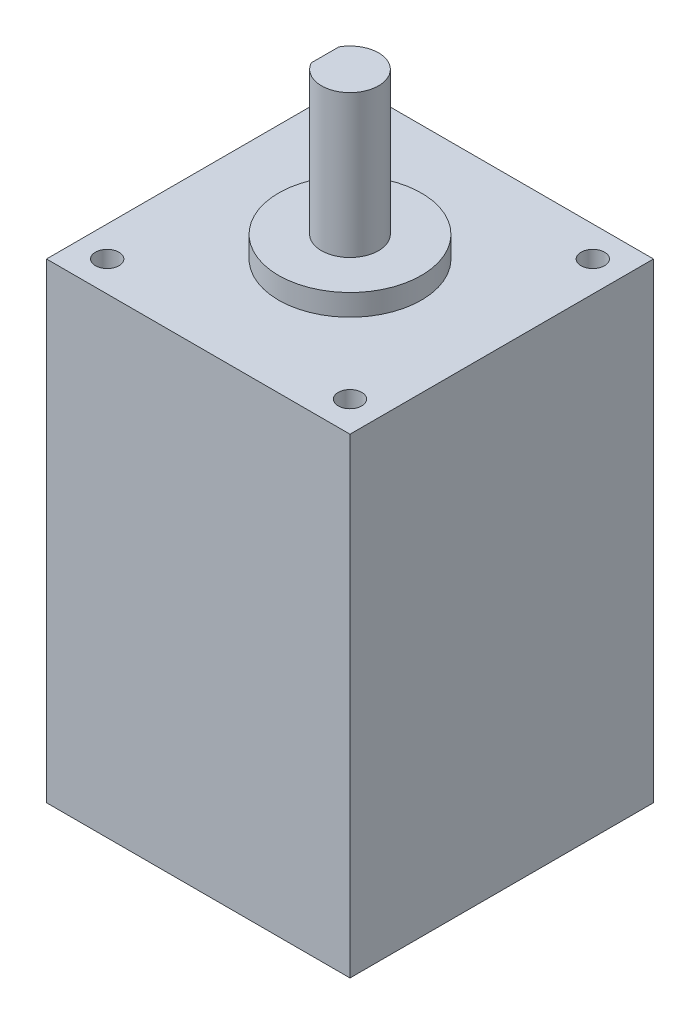
ISO-10303-21;
HEADER;
FILE_DESCRIPTION(('STEP AP214'),'2;1');
FILE_NAME('part.step','',(''),(''),'','','');
FILE_SCHEMA(('AUTOMOTIVE_DESIGN { 1 0 10303 214 1 1 1 1 }'));
ENDSEC;
DATA;
#1=APPLICATION_CONTEXT('core data for automotive mechanical design processes');
#2=APPLICATION_PROTOCOL_DEFINITION('international standard','automotive_design',2000,#1);
#3=PRODUCT_CONTEXT('',#1,'mechanical');
#4=PRODUCT('Part','Part','',(#3));
#5=PRODUCT_RELATED_PRODUCT_CATEGORY('part','',(#4));
#6=PRODUCT_DEFINITION_FORMATION('','',#4);
#7=PRODUCT_DEFINITION_CONTEXT('part definition',#1,'design');
#8=PRODUCT_DEFINITION('design','',#6,#7);
#9=PRODUCT_DEFINITION_SHAPE('','',#8);
#10=(LENGTH_UNIT() NAMED_UNIT(*) SI_UNIT(.MILLI.,.METRE.));
#11=(NAMED_UNIT(*) PLANE_ANGLE_UNIT() SI_UNIT($,.RADIAN.));
#12=(NAMED_UNIT(*) SI_UNIT($,.STERADIAN.) SOLID_ANGLE_UNIT());
#13=UNCERTAINTY_MEASURE_WITH_UNIT(LENGTH_MEASURE(1.E-05),#10,'distance_accuracy_value','');
#14=(GEOMETRIC_REPRESENTATION_CONTEXT(3) GLOBAL_UNCERTAINTY_ASSIGNED_CONTEXT((#13)) GLOBAL_UNIT_ASSIGNED_CONTEXT((#10,
#11,#12)) REPRESENTATION_CONTEXT('',''));
#15=CARTESIAN_POINT('',(0.,0.,0.));
#16=DIRECTION('',(0.,0.,1.));
#17=DIRECTION('',(1.,0.,0.));
#18=AXIS2_PLACEMENT_3D('',#15,#16,#17);
#19=CARTESIAN_POINT('',(0.,65.95,-42.5));
#20=DIRECTION('',(-1.,0.,0.));
#21=DIRECTION('',(0.,0.,1.));
#22=AXIS2_PLACEMENT_3D('',#19,#20,#21);
#23=PLANE('',#22);
#24=DIRECTION('',(0.,0.,-1.));
#25=VECTOR('',#24,1.);
#26=CARTESIAN_POINT('',(0.,0.,-42.5));
#27=LINE('',#26,#25);
#28=CARTESIAN_POINT('',(0.,0.,0.));
#29=VERTEX_POINT('',#28);
#30=CARTESIAN_POINT('',(0.,0.,-42.5));
#31=VERTEX_POINT('',#30);
#32=EDGE_CURVE('E164',#29,#31,#27,.T.);
#33=ORIENTED_EDGE('',*,*,#32,.T.);
#34=DIRECTION('',(0.,-1.,0.));
#35=VECTOR('',#34,1.);
#36=CARTESIAN_POINT('',(0.,65.95,-42.5));
#37=LINE('',#36,#35);
#38=CARTESIAN_POINT('',(0.,65.95,-42.5));
#39=VERTEX_POINT('',#38);
#40=EDGE_CURVE('E43',#39,#31,#37,.T.);
#41=ORIENTED_EDGE('',*,*,#40,.F.);
#42=DIRECTION('',(0.,0.,-1.));
#43=VECTOR('',#42,1.);
#44=CARTESIAN_POINT('',(0.,65.95,-42.5));
#45=LINE('',#44,#43);
#46=CARTESIAN_POINT('',(0.,65.95,0.));
#47=VERTEX_POINT('',#46);
#48=EDGE_CURVE('E167',#47,#39,#45,.T.);
#49=ORIENTED_EDGE('',*,*,#48,.F.);
#50=DIRECTION('',(0.,-1.,0.));
#51=VECTOR('',#50,1.);
#52=CARTESIAN_POINT('',(0.,65.95,0.));
#53=LINE('',#52,#51);
#54=EDGE_CURVE('E173',#47,#29,#53,.T.);
#55=ORIENTED_EDGE('',*,*,#54,.T.);
#56=EDGE_LOOP('',(#33,#41,#49,#55));
#57=FACE_BOUND('',#56,.T.);
#58=ADVANCED_FACE('F40',(#57),#23,.F.);
#59=CARTESIAN_POINT('',(-42.5,65.95,-42.5));
#60=DIRECTION('',(0.,0.,1.));
#61=DIRECTION('',(1.,0.,0.));
#62=AXIS2_PLACEMENT_3D('',#59,#60,#61);
#63=PLANE('',#62);
#64=DIRECTION('',(-1.,0.,0.));
#65=VECTOR('',#64,1.);
#66=CARTESIAN_POINT('',(-42.5,0.,-42.5));
#67=LINE('',#66,#65);
#68=CARTESIAN_POINT('',(-42.5,0.,-42.5));
#69=VERTEX_POINT('',#68);
#70=EDGE_CURVE('E176',#31,#69,#67,.T.);
#71=ORIENTED_EDGE('',*,*,#70,.T.);
#72=DIRECTION('',(0.,-1.,0.));
#73=VECTOR('',#72,1.);
#74=CARTESIAN_POINT('',(-42.5,65.95,-42.5));
#75=LINE('',#74,#73);
#76=CARTESIAN_POINT('',(-42.5,65.95,-42.5));
#77=VERTEX_POINT('',#76);
#78=EDGE_CURVE('E183',#77,#69,#75,.T.);
#79=ORIENTED_EDGE('',*,*,#78,.F.);
#80=DIRECTION('',(-1.,0.,0.));
#81=VECTOR('',#80,1.);
#82=CARTESIAN_POINT('',(-42.5,65.95,-42.5));
#83=LINE('',#82,#81);
#84=EDGE_CURVE('E94',#39,#77,#83,.T.);
#85=ORIENTED_EDGE('',*,*,#84,.F.);
#86=ORIENTED_EDGE('',*,*,#40,.T.);
#87=EDGE_LOOP('',(#71,#79,#85,#86));
#88=FACE_BOUND('',#87,.T.);
#89=ADVANCED_FACE('F189',(#88),#63,.F.);
#90=CARTESIAN_POINT('',(-42.5,65.95,0.));
#91=DIRECTION('',(1.,0.,0.));
#92=DIRECTION('',(0.,0.,-1.));
#93=AXIS2_PLACEMENT_3D('',#90,#91,#92);
#94=PLANE('',#93);
#95=DIRECTION('',(0.,0.,1.));
#96=VECTOR('',#95,1.);
#97=CARTESIAN_POINT('',(-42.5,0.,0.));
#98=LINE('',#97,#96);
#99=CARTESIAN_POINT('',(-42.5,0.,0.));
#100=VERTEX_POINT('',#99);
#101=EDGE_CURVE('E178',#69,#100,#98,.T.);
#102=ORIENTED_EDGE('',*,*,#101,.T.);
#103=DIRECTION('',(0.,-1.,0.));
#104=VECTOR('',#103,1.);
#105=CARTESIAN_POINT('',(-42.5,65.95,0.));
#106=LINE('',#105,#104);
#107=CARTESIAN_POINT('',(-42.5,65.95,0.));
#108=VERTEX_POINT('',#107);
#109=EDGE_CURVE('E182',#108,#100,#106,.T.);
#110=ORIENTED_EDGE('',*,*,#109,.F.);
#111=DIRECTION('',(0.,0.,1.));
#112=VECTOR('',#111,1.);
#113=CARTESIAN_POINT('',(-42.5,65.95,0.));
#114=LINE('',#113,#112);
#115=EDGE_CURVE('E170',#77,#108,#114,.T.);
#116=ORIENTED_EDGE('',*,*,#115,.F.);
#117=ORIENTED_EDGE('',*,*,#78,.T.);
#118=EDGE_LOOP('',(#102,#110,#116,#117));
#119=FACE_BOUND('',#118,.T.);
#120=ADVANCED_FACE('F196',(#119),#94,.F.);
#121=CARTESIAN_POINT('',(0.,65.95,0.));
#122=DIRECTION('',(0.,0.,-1.));
#123=DIRECTION('',(-1.,0.,0.));
#124=AXIS2_PLACEMENT_3D('',#121,#122,#123);
#125=PLANE('',#124);
#126=DIRECTION('',(1.,0.,0.));
#127=VECTOR('',#126,1.);
#128=CARTESIAN_POINT('',(0.,0.,0.));
#129=LINE('',#128,#127);
#130=EDGE_CURVE('E86',#100,#29,#129,.T.);
#131=ORIENTED_EDGE('',*,*,#130,.T.);
#132=ORIENTED_EDGE('',*,*,#54,.F.);
#133=DIRECTION('',(1.,0.,0.));
#134=VECTOR('',#133,1.);
#135=CARTESIAN_POINT('',(0.,65.95,0.));
#136=LINE('',#135,#134);
#137=EDGE_CURVE('E65',#108,#47,#136,.T.);
#138=ORIENTED_EDGE('',*,*,#137,.F.);
#139=ORIENTED_EDGE('',*,*,#109,.T.);
#140=EDGE_LOOP('',(#131,#132,#138,#139));
#141=FACE_BOUND('',#140,.T.);
#142=ADVANCED_FACE('F197',(#141),#125,.F.);
#143=CARTESIAN_POINT('',(0.,65.95,0.));
#144=DIRECTION('',(0.,-1.,0.));
#145=DIRECTION('',(0.,0.,-1.));
#146=AXIS2_PLACEMENT_3D('',#143,#144,#145);
#147=PLANE('',#146);
#148=CARTESIAN_POINT('',(-4.25,65.95,-38.25));
#149=DIRECTION('',(0.,1.,0.));
#150=DIRECTION('',(0.,0.,1.));
#151=AXIS2_PLACEMENT_3D('',#148,#149,#150);
#152=CIRCLE('',#151,1.65);
#153=CARTESIAN_POINT('',(-4.25,65.95,-36.6));
#154=VERTEX_POINT('',#153);
#155=EDGE_CURVE('E133',#154,#154,#152,.T.);
#156=ORIENTED_EDGE('',*,*,#155,.F.);
#157=EDGE_LOOP('',(#156));
#158=FACE_BOUND('',#157,.T.);
#159=CARTESIAN_POINT('',(-4.25,65.95,-4.25));
#160=DIRECTION('',(0.,1.,0.));
#161=DIRECTION('',(0.,0.,1.));
#162=AXIS2_PLACEMENT_3D('',#159,#160,#161);
#163=CIRCLE('',#162,1.65);
#164=CARTESIAN_POINT('',(-4.25,65.95,-2.6));
#165=VERTEX_POINT('',#164);
#166=EDGE_CURVE('E142',#165,#165,#163,.T.);
#167=ORIENTED_EDGE('',*,*,#166,.F.);
#168=EDGE_LOOP('',(#167));
#169=FACE_BOUND('',#168,.T.);
#170=CARTESIAN_POINT('',(-38.25,65.95,-4.25));
#171=DIRECTION('',(0.,1.,0.));
#172=DIRECTION('',(0.,0.,1.));
#173=AXIS2_PLACEMENT_3D('',#170,#171,#172);
#174=CIRCLE('',#173,1.65);
#175=CARTESIAN_POINT('',(-38.25,65.95,-2.6));
#176=VERTEX_POINT('',#175);
#177=EDGE_CURVE('E148',#176,#176,#174,.T.);
#178=ORIENTED_EDGE('',*,*,#177,.F.);
#179=EDGE_LOOP('',(#178));
#180=FACE_BOUND('',#179,.T.);
#181=CARTESIAN_POINT('',(-38.25,65.95,-38.25));
#182=DIRECTION('',(0.,1.,0.));
#183=DIRECTION('',(0.,0.,1.));
#184=AXIS2_PLACEMENT_3D('',#181,#182,#183);
#185=CIRCLE('',#184,1.65);
#186=CARTESIAN_POINT('',(-38.25,65.95,-36.6));
#187=VERTEX_POINT('',#186);
#188=EDGE_CURVE('E154',#187,#187,#185,.T.);
#189=ORIENTED_EDGE('',*,*,#188,.F.);
#190=EDGE_LOOP('',(#189));
#191=FACE_BOUND('',#190,.T.);
#192=CARTESIAN_POINT('',(-21.25,65.95,-21.25));
#193=DIRECTION('',(0.,1.,0.));
#194=DIRECTION('',(0.,0.,1.));
#195=AXIS2_PLACEMENT_3D('',#192,#193,#194);
#196=CIRCLE('',#195,10.);
#197=CARTESIAN_POINT('',(-21.25,65.95,-11.25));
#198=VERTEX_POINT('',#197);
#199=EDGE_CURVE('E48',#198,#198,#196,.T.);
#200=ORIENTED_EDGE('',*,*,#199,.F.);
#201=EDGE_LOOP('',(#200));
#202=FACE_BOUND('',#201,.T.);
#203=ORIENTED_EDGE('',*,*,#48,.T.);
#204=ORIENTED_EDGE('',*,*,#84,.T.);
#205=ORIENTED_EDGE('',*,*,#115,.T.);
#206=ORIENTED_EDGE('',*,*,#137,.T.);
#207=EDGE_LOOP('',(#203,#204,#205,#206));
#208=FACE_BOUND('',#207,.T.);
#209=ADVANCED_FACE('F198',(#158,#169,#180,#191,#202,#208),#147,.F.);
#210=CARTESIAN_POINT('',(0.,0.,0.));
#211=DIRECTION('',(0.,-1.,0.));
#212=DIRECTION('',(0.,0.,-1.));
#213=AXIS2_PLACEMENT_3D('',#210,#211,#212);
#214=PLANE('',#213);
#215=ORIENTED_EDGE('',*,*,#32,.F.);
#216=ORIENTED_EDGE('',*,*,#130,.F.);
#217=ORIENTED_EDGE('',*,*,#101,.F.);
#218=ORIENTED_EDGE('',*,*,#70,.F.);
#219=EDGE_LOOP('',(#215,#216,#217,#218));
#220=FACE_BOUND('',#219,.T.);
#221=ADVANCED_FACE('F194',(#220),#214,.T.);
#222=CARTESIAN_POINT('',(-21.25,68.95,-21.25));
#223=DIRECTION('',(0.,-1.,0.));
#224=DIRECTION('',(0.,0.,-1.));
#225=AXIS2_PLACEMENT_3D('',#222,#223,#224);
#226=CYLINDRICAL_SURFACE('',#225,10.);
#227=CARTESIAN_POINT('',(-21.25,68.95,-21.25));
#228=DIRECTION('',(0.,1.,0.));
#229=DIRECTION('',(0.,0.,1.));
#230=AXIS2_PLACEMENT_3D('',#227,#228,#229);
#231=CIRCLE('',#230,10.);
#232=CARTESIAN_POINT('',(-21.25,68.95,-11.25));
#233=VERTEX_POINT('',#232);
#234=EDGE_CURVE('E160',#233,#233,#231,.T.);
#235=ORIENTED_EDGE('',*,*,#234,.F.);
#236=EDGE_LOOP('',(#235));
#237=FACE_BOUND('',#236,.T.);
#238=ORIENTED_EDGE('',*,*,#199,.T.);
#239=EDGE_LOOP('',(#238));
#240=FACE_BOUND('',#239,.T.);
#241=ADVANCED_FACE('F206',(#237,#240),#226,.T.);
#242=CARTESIAN_POINT('',(-21.25,68.95,-21.25));
#243=DIRECTION('',(0.,1.,0.));
#244=DIRECTION('',(0.,0.,1.));
#245=AXIS2_PLACEMENT_3D('',#242,#243,#244);
#246=PLANE('',#245);
#247=CARTESIAN_POINT('',(-21.25,68.95,-21.25));
#248=DIRECTION('',(0.,1.,0.));
#249=DIRECTION('',(0.,0.,1.));
#250=AXIS2_PLACEMENT_3D('',#247,#248,#249);
#251=CIRCLE('',#250,4.);
#252=CARTESIAN_POINT('',(-21.25,68.95,-17.25));
#253=VERTEX_POINT('',#252);
#254=EDGE_CURVE('E11',#253,#253,#251,.T.);
#255=ORIENTED_EDGE('',*,*,#254,.F.);
#256=EDGE_LOOP('',(#255));
#257=FACE_BOUND('',#256,.T.);
#258=ORIENTED_EDGE('',*,*,#234,.T.);
#259=EDGE_LOOP('',(#258));
#260=FACE_BOUND('',#259,.T.);
#261=ADVANCED_FACE('F242',(#257,#260),#246,.T.);
#262=CARTESIAN_POINT('',(-21.25,88.95,-21.25));
#263=DIRECTION('',(0.,-1.,0.));
#264=DIRECTION('',(0.,0.,-1.));
#265=AXIS2_PLACEMENT_3D('',#262,#263,#264);
#266=CYLINDRICAL_SURFACE('',#265,4.);
#267=CARTESIAN_POINT('',(-21.25,88.95,-21.25));
#268=DIRECTION('',(0.,1.,0.));
#269=DIRECTION('',(0.,0.,1.));
#270=AXIS2_PLACEMENT_3D('',#267,#268,#269);
#271=CIRCLE('',#270,4.);
#272=CARTESIAN_POINT('',(-24.75,88.95,-19.3135083268963));
#273=VERTEX_POINT('',#272);
#274=CARTESIAN_POINT('',(-24.75,88.95,-23.1864916731037));
#275=VERTEX_POINT('',#274);
#276=EDGE_CURVE('E131',#273,#275,#271,.T.);
#277=ORIENTED_EDGE('',*,*,#276,.F.);
#278=DIRECTION('',(0.,1.,0.));
#279=VECTOR('',#278,1.);
#280=CARTESIAN_POINT('',(-24.75,76.95,-19.3135083268963));
#281=LINE('',#280,#279);
#282=CARTESIAN_POINT('',(-24.75,76.95,-19.3135083268963));
#283=VERTEX_POINT('',#282);
#284=EDGE_CURVE('E56',#283,#273,#281,.T.);
#285=ORIENTED_EDGE('',*,*,#284,.F.);
#286=CARTESIAN_POINT('',(-21.25,76.95,-21.25));
#287=DIRECTION('',(0.,1.,0.));
#288=DIRECTION('',(0.,0.,1.));
#289=AXIS2_PLACEMENT_3D('',#286,#287,#288);
#290=CIRCLE('',#289,4.);
#291=CARTESIAN_POINT('',(-24.75,76.95,-23.1864916731037));
#292=VERTEX_POINT('',#291);
#293=EDGE_CURVE('E117',#292,#283,#290,.T.);
#294=ORIENTED_EDGE('',*,*,#293,.F.);
#295=DIRECTION('',(0.,1.,0.));
#296=VECTOR('',#295,1.);
#297=CARTESIAN_POINT('',(-24.75,76.95,-23.1864916731037));
#298=LINE('',#297,#296);
#299=EDGE_CURVE('E125',#292,#275,#298,.T.);
#300=ORIENTED_EDGE('',*,*,#299,.T.);
#301=EDGE_LOOP('',(#277,#285,#294,#300));
#302=FACE_BOUND('',#301,.T.);
#303=ORIENTED_EDGE('',*,*,#254,.T.);
#304=EDGE_LOOP('',(#303));
#305=FACE_BOUND('',#304,.T.);
#306=ADVANCED_FACE('F128',(#302,#305),#266,.T.);
#307=CARTESIAN_POINT('',(-21.25,88.95,-21.25));
#308=DIRECTION('',(0.,1.,0.));
#309=DIRECTION('',(0.,0.,1.));
#310=AXIS2_PLACEMENT_3D('',#307,#308,#309);
#311=PLANE('',#310);
#312=DIRECTION('',(0.,0.,-1.));
#313=VECTOR('',#312,1.);
#314=CARTESIAN_POINT('',(-24.75,88.95,-19.3135083268963));
#315=LINE('',#314,#313);
#316=EDGE_CURVE('E122',#273,#275,#315,.T.);
#317=ORIENTED_EDGE('',*,*,#316,.F.);
#318=ORIENTED_EDGE('',*,*,#276,.T.);
#319=EDGE_LOOP('',(#317,#318));
#320=FACE_BOUND('',#319,.T.);
#321=ADVANCED_FACE('F273',(#320),#311,.T.);
#322=CARTESIAN_POINT('',(-38.25,54.45,-38.25));
#323=DIRECTION('',(0.,1.,0.));
#324=DIRECTION('',(0.,0.,1.));
#325=AXIS2_PLACEMENT_3D('',#322,#323,#324);
#326=CONICAL_SURFACE('',#325,1.65,1.02974425867665);
#327=CARTESIAN_POINT('',(-38.25,53.4585799786045,-38.25));
#328=VERTEX_POINT('',#327);
#329=VERTEX_LOOP('',#328);
#330=FACE_BOUND('',#329,.T.);
#331=CARTESIAN_POINT('',(-38.25,54.45,-38.25));
#332=DIRECTION('',(0.,1.,0.));
#333=DIRECTION('',(0.,0.,1.));
#334=AXIS2_PLACEMENT_3D('',#331,#332,#333);
#335=CIRCLE('',#334,1.65);
#336=CARTESIAN_POINT('',(-38.25,54.45,-36.6));
#337=VERTEX_POINT('',#336);
#338=EDGE_CURVE('E157',#337,#337,#335,.T.);
#339=ORIENTED_EDGE('',*,*,#338,.T.);
#340=EDGE_LOOP('',(#339));
#341=FACE_BOUND('',#340,.T.);
#342=ADVANCED_FACE('F267',(#330,#341),#326,.F.);
#343=CARTESIAN_POINT('',(-38.25,65.95,-38.25));
#344=DIRECTION('',(0.,1.,0.));
#345=DIRECTION('',(0.,0.,1.));
#346=AXIS2_PLACEMENT_3D('',#343,#344,#345);
#347=CYLINDRICAL_SURFACE('',#346,1.65);
#348=ORIENTED_EDGE('',*,*,#338,.F.);
#349=EDGE_LOOP('',(#348));
#350=FACE_BOUND('',#349,.T.);
#351=ORIENTED_EDGE('',*,*,#188,.T.);
#352=EDGE_LOOP('',(#351));
#353=FACE_BOUND('',#352,.T.);
#354=ADVANCED_FACE('F272',(#350,#353),#347,.F.);
#355=CARTESIAN_POINT('',(-38.25,54.45,-4.25));
#356=DIRECTION('',(0.,1.,0.));
#357=DIRECTION('',(0.,0.,1.));
#358=AXIS2_PLACEMENT_3D('',#355,#356,#357);
#359=CONICAL_SURFACE('',#358,1.65,1.02974425867665);
#360=CARTESIAN_POINT('',(-38.25,53.4585799786045,-4.25));
#361=VERTEX_POINT('',#360);
#362=VERTEX_LOOP('',#361);
#363=FACE_BOUND('',#362,.T.);
#364=CARTESIAN_POINT('',(-38.25,54.45,-4.25));
#365=DIRECTION('',(0.,1.,0.));
#366=DIRECTION('',(0.,0.,1.));
#367=AXIS2_PLACEMENT_3D('',#364,#365,#366);
#368=CIRCLE('',#367,1.65);
#369=CARTESIAN_POINT('',(-38.25,54.45,-2.6));
#370=VERTEX_POINT('',#369);
#371=EDGE_CURVE('E151',#370,#370,#368,.T.);
#372=ORIENTED_EDGE('',*,*,#371,.T.);
#373=EDGE_LOOP('',(#372));
#374=FACE_BOUND('',#373,.T.);
#375=ADVANCED_FACE('F286',(#363,#374),#359,.F.);
#376=CARTESIAN_POINT('',(-38.25,65.95,-4.25));
#377=DIRECTION('',(0.,1.,0.));
#378=DIRECTION('',(0.,0.,1.));
#379=AXIS2_PLACEMENT_3D('',#376,#377,#378);
#380=CYLINDRICAL_SURFACE('',#379,1.65);
#381=ORIENTED_EDGE('',*,*,#371,.F.);
#382=EDGE_LOOP('',(#381));
#383=FACE_BOUND('',#382,.T.);
#384=ORIENTED_EDGE('',*,*,#177,.T.);
#385=EDGE_LOOP('',(#384));
#386=FACE_BOUND('',#385,.T.);
#387=ADVANCED_FACE('F298',(#383,#386),#380,.F.);
#388=CARTESIAN_POINT('',(-4.25,54.45,-4.25));
#389=DIRECTION('',(0.,1.,0.));
#390=DIRECTION('',(0.,0.,1.));
#391=AXIS2_PLACEMENT_3D('',#388,#389,#390);
#392=CONICAL_SURFACE('',#391,1.65,1.02974425867665);
#393=CARTESIAN_POINT('',(-4.25,53.4585799786045,-4.25));
#394=VERTEX_POINT('',#393);
#395=VERTEX_LOOP('',#394);
#396=FACE_BOUND('',#395,.T.);
#397=CARTESIAN_POINT('',(-4.25,54.45,-4.25));
#398=DIRECTION('',(0.,1.,0.));
#399=DIRECTION('',(0.,0.,1.));
#400=AXIS2_PLACEMENT_3D('',#397,#398,#399);
#401=CIRCLE('',#400,1.65);
#402=CARTESIAN_POINT('',(-4.25,54.45,-2.6));
#403=VERTEX_POINT('',#402);
#404=EDGE_CURVE('E145',#403,#403,#401,.T.);
#405=ORIENTED_EDGE('',*,*,#404,.T.);
#406=EDGE_LOOP('',(#405));
#407=FACE_BOUND('',#406,.T.);
#408=ADVANCED_FACE('F308',(#396,#407),#392,.F.);
#409=CARTESIAN_POINT('',(-4.25,65.95,-4.25));
#410=DIRECTION('',(0.,1.,0.));
#411=DIRECTION('',(0.,0.,1.));
#412=AXIS2_PLACEMENT_3D('',#409,#410,#411);
#413=CYLINDRICAL_SURFACE('',#412,1.65);
#414=ORIENTED_EDGE('',*,*,#404,.F.);
#415=EDGE_LOOP('',(#414));
#416=FACE_BOUND('',#415,.T.);
#417=ORIENTED_EDGE('',*,*,#166,.T.);
#418=EDGE_LOOP('',(#417));
#419=FACE_BOUND('',#418,.T.);
#420=ADVANCED_FACE('F319',(#416,#419),#413,.F.);
#421=CARTESIAN_POINT('',(-4.25,54.45,-38.25));
#422=DIRECTION('',(0.,1.,0.));
#423=DIRECTION('',(0.,0.,1.));
#424=AXIS2_PLACEMENT_3D('',#421,#422,#423);
#425=CONICAL_SURFACE('',#424,1.65,1.02974425867665);
#426=CARTESIAN_POINT('',(-4.25,53.4585799786045,-38.25));
#427=VERTEX_POINT('',#426);
#428=VERTEX_LOOP('',#427);
#429=FACE_BOUND('',#428,.T.);
#430=CARTESIAN_POINT('',(-4.25,54.45,-38.25));
#431=DIRECTION('',(0.,1.,0.));
#432=DIRECTION('',(0.,0.,1.));
#433=AXIS2_PLACEMENT_3D('',#430,#431,#432);
#434=CIRCLE('',#433,1.65);
#435=CARTESIAN_POINT('',(-4.25,54.45,-36.6));
#436=VERTEX_POINT('',#435);
#437=EDGE_CURVE('E139',#436,#436,#434,.T.);
#438=ORIENTED_EDGE('',*,*,#437,.T.);
#439=EDGE_LOOP('',(#438));
#440=FACE_BOUND('',#439,.T.);
#441=ADVANCED_FACE('F329',(#429,#440),#425,.F.);
#442=CARTESIAN_POINT('',(-4.25,65.95,-38.25));
#443=DIRECTION('',(0.,1.,0.));
#444=DIRECTION('',(0.,0.,1.));
#445=AXIS2_PLACEMENT_3D('',#442,#443,#444);
#446=CYLINDRICAL_SURFACE('',#445,1.65);
#447=ORIENTED_EDGE('',*,*,#437,.F.);
#448=EDGE_LOOP('',(#447));
#449=FACE_BOUND('',#448,.T.);
#450=ORIENTED_EDGE('',*,*,#155,.T.);
#451=EDGE_LOOP('',(#450));
#452=FACE_BOUND('',#451,.T.);
#453=ADVANCED_FACE('F341',(#449,#452),#446,.F.);
#454=CARTESIAN_POINT('',(-24.75,76.95,-19.3135083268963));
#455=DIRECTION('',(1.,0.,0.));
#456=DIRECTION('',(0.,0.,-1.));
#457=AXIS2_PLACEMENT_3D('',#454,#455,#456);
#458=PLANE('',#457);
#459=ORIENTED_EDGE('',*,*,#316,.T.);
#460=ORIENTED_EDGE('',*,*,#299,.F.);
#461=DIRECTION('',(0.,0.,-1.));
#462=VECTOR('',#461,1.);
#463=CARTESIAN_POINT('',(-24.75,76.95,-19.3135083268963));
#464=LINE('',#463,#462);
#465=EDGE_CURVE('E119',#283,#292,#464,.T.);
#466=ORIENTED_EDGE('',*,*,#465,.F.);
#467=ORIENTED_EDGE('',*,*,#284,.T.);
#468=EDGE_LOOP('',(#459,#460,#466,#467));
#469=FACE_BOUND('',#468,.T.);
#470=ADVANCED_FACE('F124',(#469),#458,.F.);
#471=CARTESIAN_POINT('',(-21.25,76.95,-21.25));
#472=DIRECTION('',(0.,1.,0.));
#473=DIRECTION('',(0.,0.,1.));
#474=AXIS2_PLACEMENT_3D('',#471,#472,#473);
#475=PLANE('',#474);
#476=ORIENTED_EDGE('',*,*,#293,.T.);
#477=ORIENTED_EDGE('',*,*,#465,.T.);
#478=EDGE_LOOP('',(#476,#477));
#479=FACE_BOUND('',#478,.T.);
#480=ADVANCED_FACE('F118',(#479),#475,.T.);
#481=CLOSED_SHELL('',(#58,#89,#120,#142,#209,#221,#241,#261,#306,#321,#342,#354,#375,#387,#408,
#420,#441,#453,#470,#480));
#482=MANIFOLD_SOLID_BREP('B2',#481);
#483=ADVANCED_BREP_SHAPE_REPRESENTATION('',(#18,#482),#14);
#484=SHAPE_DEFINITION_REPRESENTATION(#9,#483);
ENDSEC;
END-ISO-10303-21;
